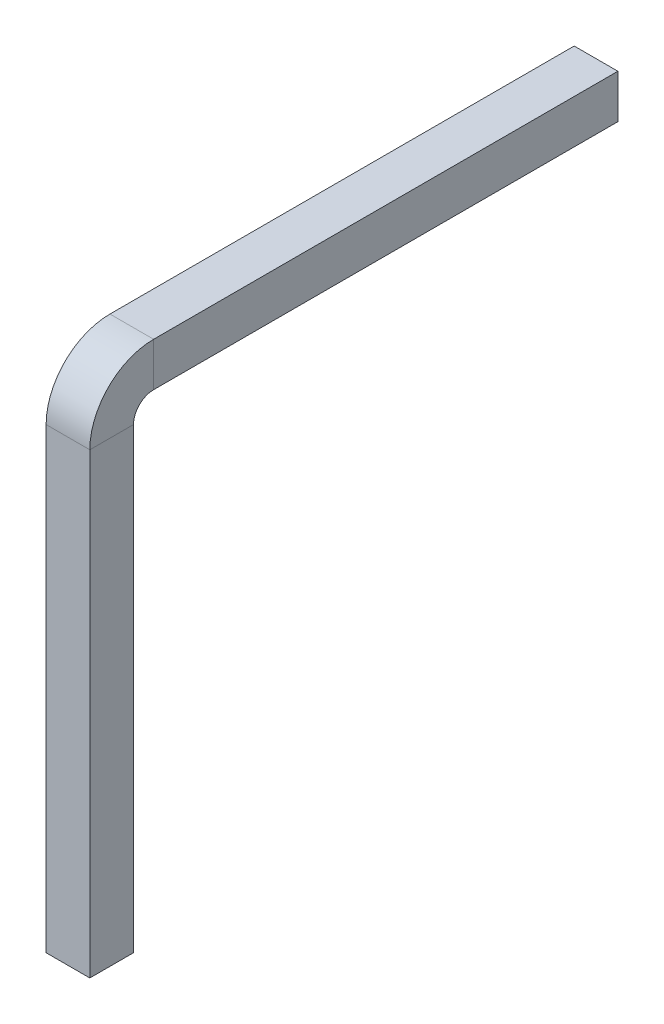
ISO-10303-21;
HEADER;
FILE_DESCRIPTION(('STEP AP214'),'2;1');
FILE_NAME('part.step','',(''),(''),'','','');
FILE_SCHEMA(('AUTOMOTIVE_DESIGN { 1 0 10303 214 1 1 1 1 }'));
ENDSEC;
DATA;
#1=APPLICATION_CONTEXT('core data for automotive mechanical design processes');
#2=APPLICATION_PROTOCOL_DEFINITION('international standard','automotive_design',2000,#1);
#3=PRODUCT_CONTEXT('',#1,'mechanical');
#4=PRODUCT('Part','Part','',(#3));
#5=PRODUCT_RELATED_PRODUCT_CATEGORY('part','',(#4));
#6=PRODUCT_DEFINITION_FORMATION('','',#4);
#7=PRODUCT_DEFINITION_CONTEXT('part definition',#1,'design');
#8=PRODUCT_DEFINITION('design','',#6,#7);
#9=PRODUCT_DEFINITION_SHAPE('','',#8);
#10=(LENGTH_UNIT() NAMED_UNIT(*) SI_UNIT(.MILLI.,.METRE.));
#11=(NAMED_UNIT(*) PLANE_ANGLE_UNIT() SI_UNIT($,.RADIAN.));
#12=(NAMED_UNIT(*) SI_UNIT($,.STERADIAN.) SOLID_ANGLE_UNIT());
#13=UNCERTAINTY_MEASURE_WITH_UNIT(LENGTH_MEASURE(1.E-05),#10,'distance_accuracy_value','');
#14=(GEOMETRIC_REPRESENTATION_CONTEXT(3) GLOBAL_UNCERTAINTY_ASSIGNED_CONTEXT((#13)) GLOBAL_UNIT_ASSIGNED_CONTEXT((#10,
#11,#12)) REPRESENTATION_CONTEXT('',''));
#15=CARTESIAN_POINT('',(0.,0.,0.));
#16=DIRECTION('',(0.,0.,1.));
#17=DIRECTION('',(1.,0.,0.));
#18=AXIS2_PLACEMENT_3D('',#15,#16,#17);
#19=CARTESIAN_POINT('',(0.,0.,0.));
#20=DIRECTION('',(0.,-1.,0.));
#21=DIRECTION('',(0.,0.,-1.));
#22=AXIS2_PLACEMENT_3D('',#19,#20,#21);
#23=PLANE('',#22);
#24=DIRECTION('',(0.,0.,1.));
#25=VECTOR('',#24,1.);
#26=CARTESIAN_POINT('',(0.120000000000001,0.,0.));
#27=LINE('',#26,#25);
#28=CARTESIAN_POINT('',(0.120000000000001,0.,-0.120000000000001));
#29=VERTEX_POINT('',#28);
#30=CARTESIAN_POINT('',(0.120000000000001,0.,0.120000000000002));
#31=VERTEX_POINT('',#30);
#32=EDGE_CURVE('E219',#29,#31,#27,.T.);
#33=ORIENTED_EDGE('',*,*,#32,.T.);
#34=DIRECTION('',(-1.,0.,0.));
#35=VECTOR('',#34,1.);
#36=CARTESIAN_POINT('',(0.,0.,0.120000000000002));
#37=LINE('',#36,#35);
#38=CARTESIAN_POINT('',(-0.120000000000001,0.,0.120000000000002));
#39=VERTEX_POINT('',#38);
#40=EDGE_CURVE('E221',#31,#39,#37,.T.);
#41=ORIENTED_EDGE('',*,*,#40,.T.);
#42=DIRECTION('',(0.,0.,-1.));
#43=VECTOR('',#42,1.);
#44=CARTESIAN_POINT('',(-0.120000000000001,0.,0.));
#45=LINE('',#44,#43);
#46=CARTESIAN_POINT('',(-0.120000000000001,0.,-0.120000000000001));
#47=VERTEX_POINT('',#46);
#48=EDGE_CURVE('E215',#39,#47,#45,.T.);
#49=ORIENTED_EDGE('',*,*,#48,.T.);
#50=DIRECTION('',(1.,0.,0.));
#51=VECTOR('',#50,1.);
#52=CARTESIAN_POINT('',(0.,0.,-0.120000000000001));
#53=LINE('',#52,#51);
#54=EDGE_CURVE('E217',#47,#29,#53,.T.);
#55=ORIENTED_EDGE('',*,*,#54,.T.);
#56=EDGE_LOOP('',(#33,#41,#49,#55));
#57=FACE_BOUND('',#56,.T.);
#58=ADVANCED_FACE('F33',(#57),#23,.T.);
#59=CARTESIAN_POINT('',(0.,7.51466781474061,-7.61466781474061));
#60=DIRECTION('',(0.,0.,1.));
#61=DIRECTION('',(0.,-1.,0.));
#62=AXIS2_PLACEMENT_3D('',#59,#60,#61);
#63=PLANE('',#62);
#64=DIRECTION('',(0.,-1.,0.));
#65=VECTOR('',#64,1.);
#66=CARTESIAN_POINT('',(0.12,7.19466781474061,-7.61466781474061));
#67=LINE('',#66,#65);
#68=CARTESIAN_POINT('',(0.12,7.63466781474061,-7.61466781474061));
#69=VERTEX_POINT('',#68);
#70=CARTESIAN_POINT('',(0.12,7.39466781474061,-7.61466781474061));
#71=VERTEX_POINT('',#70);
#72=EDGE_CURVE('E198',#69,#71,#67,.T.);
#73=ORIENTED_EDGE('',*,*,#72,.T.);
#74=DIRECTION('',(-1.,0.,0.));
#75=VECTOR('',#74,1.);
#76=CARTESIAN_POINT('',(-0.32,7.39466781474061,-7.61466781474061));
#77=LINE('',#76,#75);
#78=CARTESIAN_POINT('',(-0.119999999999999,7.39466781474061,-7.61466781474061));
#79=VERTEX_POINT('',#78);
#80=EDGE_CURVE('E200',#71,#79,#77,.T.);
#81=ORIENTED_EDGE('',*,*,#80,.T.);
#82=DIRECTION('',(0.,1.,0.));
#83=VECTOR('',#82,1.);
#84=CARTESIAN_POINT('',(-0.119999999999999,7.83466781474061,-7.61466781474061));
#85=LINE('',#84,#83);
#86=CARTESIAN_POINT('',(-0.119999999999999,7.63466781474061,-7.61466781474061));
#87=VERTEX_POINT('',#86);
#88=EDGE_CURVE('E191',#79,#87,#85,.T.);
#89=ORIENTED_EDGE('',*,*,#88,.T.);
#90=DIRECTION('',(1.,0.,0.));
#91=VECTOR('',#90,1.);
#92=CARTESIAN_POINT('',(0.32,7.63466781474061,-7.61466781474061));
#93=LINE('',#92,#91);
#94=EDGE_CURVE('E196',#87,#69,#93,.T.);
#95=ORIENTED_EDGE('',*,*,#94,.T.);
#96=EDGE_LOOP('',(#73,#81,#89,#95));
#97=FACE_BOUND('',#96,.T.);
#98=ADVANCED_FACE('F293',(#97),#63,.F.);
#99=CARTESIAN_POINT('',(-0.32,0.,-0.32));
#100=DIRECTION('',(-1.,0.,0.));
#101=DIRECTION('',(0.,0.,1.));
#102=AXIS2_PLACEMENT_3D('',#99,#100,#101);
#103=PLANE('',#102);
#104=DIRECTION('',(0.,1.,0.));
#105=VECTOR('',#104,1.);
#106=CARTESIAN_POINT('',(-0.32,0.,-0.32));
#107=LINE('',#106,#105);
#108=CARTESIAN_POINT('',(-0.32,0.199999999999999,-0.32));
#109=VERTEX_POINT('',#108);
#110=CARTESIAN_POINT('',(-0.32,6.9,-0.32));
#111=VERTEX_POINT('',#110);
#112=EDGE_CURVE('E121',#109,#111,#107,.T.);
#113=ORIENTED_EDGE('',*,*,#112,.F.);
#114=DIRECTION('',(0.,0.,1.));
#115=VECTOR('',#114,1.);
#116=CARTESIAN_POINT('',(-0.32,0.199999999999999,-0.32));
#117=LINE('',#116,#115);
#118=CARTESIAN_POINT('',(-0.32,0.199999999999999,0.32));
#119=VERTEX_POINT('',#118);
#120=EDGE_CURVE('E11',#109,#119,#117,.T.);
#121=ORIENTED_EDGE('',*,*,#120,.T.);
#122=DIRECTION('',(0.,1.,0.));
#123=VECTOR('',#122,1.);
#124=CARTESIAN_POINT('',(-0.32,0.,0.32));
#125=LINE('',#124,#123);
#126=CARTESIAN_POINT('',(-0.32,6.9,0.32));
#127=VERTEX_POINT('',#126);
#128=EDGE_CURVE('E153',#119,#127,#125,.T.);
#129=ORIENTED_EDGE('',*,*,#128,.T.);
#130=DIRECTION('',(0.,0.,1.));
#131=VECTOR('',#130,1.);
#132=CARTESIAN_POINT('',(-0.32,6.9,-0.32));
#133=LINE('',#132,#131);
#134=EDGE_CURVE('E130',#111,#127,#133,.T.);
#135=ORIENTED_EDGE('',*,*,#134,.F.);
#136=EDGE_LOOP('',(#113,#121,#129,#135));
#137=FACE_BOUND('',#136,.T.);
#138=ADVANCED_FACE('F151',(#137),#103,.T.);
#139=CARTESIAN_POINT('',(0.32,0.,0.320000000000001));
#140=DIRECTION('',(0.,0.,1.));
#141=DIRECTION('',(1.,0.,0.));
#142=AXIS2_PLACEMENT_3D('',#139,#140,#141);
#143=PLANE('',#142);
#144=ORIENTED_EDGE('',*,*,#128,.F.);
#145=DIRECTION('',(1.,0.,0.));
#146=VECTOR('',#145,1.);
#147=CARTESIAN_POINT('',(0.32,0.199999999999999,0.320000000000001));
#148=LINE('',#147,#146);
#149=CARTESIAN_POINT('',(0.32,0.199999999999999,0.320000000000001));
#150=VERTEX_POINT('',#149);
#151=EDGE_CURVE('E212',#119,#150,#148,.T.);
#152=ORIENTED_EDGE('',*,*,#151,.T.);
#153=DIRECTION('',(0.,1.,0.));
#154=VECTOR('',#153,1.);
#155=CARTESIAN_POINT('',(0.32,0.,0.320000000000001));
#156=LINE('',#155,#154);
#157=CARTESIAN_POINT('',(0.32,6.9,0.320000000000001));
#158=VERTEX_POINT('',#157);
#159=EDGE_CURVE('E173',#150,#158,#156,.T.);
#160=ORIENTED_EDGE('',*,*,#159,.T.);
#161=DIRECTION('',(1.,0.,0.));
#162=VECTOR('',#161,1.);
#163=CARTESIAN_POINT('',(0.32,6.9,0.320000000000001));
#164=LINE('',#163,#162);
#165=EDGE_CURVE('E156',#127,#158,#164,.T.);
#166=ORIENTED_EDGE('',*,*,#165,.F.);
#167=EDGE_LOOP('',(#144,#152,#160,#166));
#168=FACE_BOUND('',#167,.T.);
#169=ADVANCED_FACE('F259',(#168),#143,.T.);
#170=CARTESIAN_POINT('',(0.32,0.,-0.32));
#171=DIRECTION('',(1.,0.,0.));
#172=DIRECTION('',(0.,0.,-1.));
#173=AXIS2_PLACEMENT_3D('',#170,#171,#172);
#174=PLANE('',#173);
#175=ORIENTED_EDGE('',*,*,#159,.F.);
#176=DIRECTION('',(0.,0.,-1.));
#177=VECTOR('',#176,1.);
#178=CARTESIAN_POINT('',(0.32,0.199999999999999,-0.32));
#179=LINE('',#178,#177);
#180=CARTESIAN_POINT('',(0.32,0.199999999999999,-0.32));
#181=VERTEX_POINT('',#180);
#182=EDGE_CURVE('E57',#150,#181,#179,.T.);
#183=ORIENTED_EDGE('',*,*,#182,.T.);
#184=DIRECTION('',(0.,1.,0.));
#185=VECTOR('',#184,1.);
#186=CARTESIAN_POINT('',(0.32,0.,-0.32));
#187=LINE('',#186,#185);
#188=CARTESIAN_POINT('',(0.32,6.9,-0.32));
#189=VERTEX_POINT('',#188);
#190=EDGE_CURVE('E149',#181,#189,#187,.T.);
#191=ORIENTED_EDGE('',*,*,#190,.T.);
#192=DIRECTION('',(0.,0.,-1.));
#193=VECTOR('',#192,1.);
#194=CARTESIAN_POINT('',(0.32,6.9,-0.32));
#195=LINE('',#194,#193);
#196=EDGE_CURVE('E175',#158,#189,#195,.T.);
#197=ORIENTED_EDGE('',*,*,#196,.F.);
#198=EDGE_LOOP('',(#175,#183,#191,#197));
#199=FACE_BOUND('',#198,.T.);
#200=ADVANCED_FACE('F263',(#199),#174,.T.);
#201=CARTESIAN_POINT('',(0.32,0.,-0.32));
#202=DIRECTION('',(0.,0.,-1.));
#203=DIRECTION('',(-1.,0.,0.));
#204=AXIS2_PLACEMENT_3D('',#201,#202,#203);
#205=PLANE('',#204);
#206=ORIENTED_EDGE('',*,*,#190,.F.);
#207=DIRECTION('',(-1.,0.,0.));
#208=VECTOR('',#207,1.);
#209=CARTESIAN_POINT('',(0.32,0.199999999999999,-0.32));
#210=LINE('',#209,#208);
#211=EDGE_CURVE('E42',#181,#109,#210,.T.);
#212=ORIENTED_EDGE('',*,*,#211,.T.);
#213=ORIENTED_EDGE('',*,*,#112,.T.);
#214=DIRECTION('',(-1.,0.,0.));
#215=VECTOR('',#214,1.);
#216=CARTESIAN_POINT('',(0.32,6.9,-0.32));
#217=LINE('',#216,#215);
#218=EDGE_CURVE('E125',#189,#111,#217,.T.);
#219=ORIENTED_EDGE('',*,*,#218,.F.);
#220=EDGE_LOOP('',(#206,#212,#213,#219));
#221=FACE_BOUND('',#220,.T.);
#222=ADVANCED_FACE('F123',(#221),#205,.T.);
#223=CARTESIAN_POINT('',(-0.32,6.9,-0.32));
#224=DIRECTION('',(-1.,0.,0.));
#225=DIRECTION('',(0.,0.,1.));
#226=AXIS2_PLACEMENT_3D('',#223,#224,#225);
#227=PLANE('',#226);
#228=CARTESIAN_POINT('',(-0.32,6.9,-0.614667814740614));
#229=DIRECTION('',(-1.,0.,0.));
#230=DIRECTION('',(0.,0.,1.));
#231=AXIS2_PLACEMENT_3D('',#228,#229,#230);
#232=CIRCLE('',#231,0.934667814740614);
#233=CARTESIAN_POINT('',(-0.32,7.83466781474061,-0.614667814740621));
#234=VERTEX_POINT('',#233);
#235=EDGE_CURVE('E160',#127,#234,#232,.T.);
#236=ORIENTED_EDGE('',*,*,#235,.T.);
#237=DIRECTION('',(0.,1.,0.));
#238=VECTOR('',#237,1.);
#239=CARTESIAN_POINT('',(-0.32,7.19466781474061,-0.614667814740616));
#240=LINE('',#239,#238);
#241=CARTESIAN_POINT('',(-0.32,7.19466781474061,-0.614667814740616));
#242=VERTEX_POINT('',#241);
#243=EDGE_CURVE('E141',#242,#234,#240,.T.);
#244=ORIENTED_EDGE('',*,*,#243,.F.);
#245=CARTESIAN_POINT('',(-0.32,6.9,-0.614667814740614));
#246=DIRECTION('',(-1.,0.,0.));
#247=DIRECTION('',(0.,0.,1.));
#248=AXIS2_PLACEMENT_3D('',#245,#246,#247);
#249=CIRCLE('',#248,0.294667814740614);
#250=EDGE_CURVE('E137',#111,#242,#249,.T.);
#251=ORIENTED_EDGE('',*,*,#250,.F.);
#252=ORIENTED_EDGE('',*,*,#134,.T.);
#253=EDGE_LOOP('',(#236,#244,#251,#252));
#254=FACE_BOUND('',#253,.T.);
#255=ADVANCED_FACE('F139',(#254),#227,.T.);
#256=CARTESIAN_POINT('',(0.,6.9,-0.614667814740614));
#257=DIRECTION('',(-1.,0.,0.));
#258=DIRECTION('',(0.,0.,1.));
#259=AXIS2_PLACEMENT_3D('',#256,#257,#258);
#260=CYLINDRICAL_SURFACE('',#259,0.934667814740615);
#261=CARTESIAN_POINT('',(0.32,6.9,-0.614667814740614));
#262=DIRECTION('',(-1.,0.,0.));
#263=DIRECTION('',(0.,0.,1.));
#264=AXIS2_PLACEMENT_3D('',#261,#262,#263);
#265=CIRCLE('',#264,0.934667814740615);
#266=CARTESIAN_POINT('',(0.32,7.83466781474061,-0.614667814740621));
#267=VERTEX_POINT('',#266);
#268=EDGE_CURVE('E178',#158,#267,#265,.T.);
#269=ORIENTED_EDGE('',*,*,#268,.T.);
#270=DIRECTION('',(1.,0.,0.));
#271=VECTOR('',#270,1.);
#272=CARTESIAN_POINT('',(0.32,7.83466781474061,-0.614667814740621));
#273=LINE('',#272,#271);
#274=EDGE_CURVE('E161',#234,#267,#273,.T.);
#275=ORIENTED_EDGE('',*,*,#274,.F.);
#276=ORIENTED_EDGE('',*,*,#235,.F.);
#277=ORIENTED_EDGE('',*,*,#165,.T.);
#278=EDGE_LOOP('',(#269,#275,#276,#277));
#279=FACE_BOUND('',#278,.T.);
#280=ADVANCED_FACE('F266',(#279),#260,.T.);
#281=CARTESIAN_POINT('',(0.32,6.9,-0.32));
#282=DIRECTION('',(1.,0.,0.));
#283=DIRECTION('',(0.,0.,-1.));
#284=AXIS2_PLACEMENT_3D('',#281,#282,#283);
#285=PLANE('',#284);
#286=CARTESIAN_POINT('',(0.32,6.9,-0.614667814740614));
#287=DIRECTION('',(-1.,0.,0.));
#288=DIRECTION('',(0.,0.,1.));
#289=AXIS2_PLACEMENT_3D('',#286,#287,#288);
#290=CIRCLE('',#289,0.294667814740614);
#291=CARTESIAN_POINT('',(0.32,7.19466781474061,-0.614667814740616));
#292=VERTEX_POINT('',#291);
#293=EDGE_CURVE('E148',#189,#292,#290,.T.);
#294=ORIENTED_EDGE('',*,*,#293,.T.);
#295=DIRECTION('',(0.,-1.,0.));
#296=VECTOR('',#295,1.);
#297=CARTESIAN_POINT('',(0.32,7.19466781474061,-0.614667814740616));
#298=LINE('',#297,#296);
#299=EDGE_CURVE('E181',#267,#292,#298,.T.);
#300=ORIENTED_EDGE('',*,*,#299,.F.);
#301=ORIENTED_EDGE('',*,*,#268,.F.);
#302=ORIENTED_EDGE('',*,*,#196,.T.);
#303=EDGE_LOOP('',(#294,#300,#301,#302));
#304=FACE_BOUND('',#303,.T.);
#305=ADVANCED_FACE('F276',(#304),#285,.T.);
#306=CARTESIAN_POINT('',(0.,6.9,-0.614667814740614));
#307=DIRECTION('',(-1.,0.,0.));
#308=DIRECTION('',(0.,0.,1.));
#309=AXIS2_PLACEMENT_3D('',#306,#307,#308);
#310=CYLINDRICAL_SURFACE('',#309,0.294667814740614);
#311=DIRECTION('',(-1.,0.,0.));
#312=VECTOR('',#311,1.);
#313=CARTESIAN_POINT('',(0.32,7.19466781474061,-0.614667814740616));
#314=LINE('',#313,#312);
#315=EDGE_CURVE('E170',#292,#242,#314,.T.);
#316=ORIENTED_EDGE('',*,*,#315,.F.);
#317=ORIENTED_EDGE('',*,*,#293,.F.);
#318=ORIENTED_EDGE('',*,*,#218,.T.);
#319=ORIENTED_EDGE('',*,*,#250,.T.);
#320=EDGE_LOOP('',(#316,#317,#318,#319));
#321=FACE_BOUND('',#320,.T.);
#322=ADVANCED_FACE('F146',(#321),#310,.F.);
#323=CARTESIAN_POINT('',(-0.32,7.19466781474061,-0.614667814740619));
#324=DIRECTION('',(-1.,0.,0.));
#325=DIRECTION('',(0.,0.,1.));
#326=AXIS2_PLACEMENT_3D('',#323,#324,#325);
#327=PLANE('',#326);
#328=DIRECTION('',(0.,0.,-1.));
#329=VECTOR('',#328,1.);
#330=CARTESIAN_POINT('',(-0.32,7.83466781474061,-0.614667814740619));
#331=LINE('',#330,#329);
#332=CARTESIAN_POINT('',(-0.32,7.83466781474061,-7.41466781474061));
#333=VERTEX_POINT('',#332);
#334=EDGE_CURVE('E163',#234,#333,#331,.T.);
#335=ORIENTED_EDGE('',*,*,#334,.T.);
#336=DIRECTION('',(0.,-1.,0.));
#337=VECTOR('',#336,1.);
#338=CARTESIAN_POINT('',(-0.32,7.19466781474061,-7.41466781474061));
#339=LINE('',#338,#337);
#340=CARTESIAN_POINT('',(-0.32,7.19466781474061,-7.41466781474061));
#341=VERTEX_POINT('',#340);
#342=EDGE_CURVE('E210',#333,#341,#339,.T.);
#343=ORIENTED_EDGE('',*,*,#342,.T.);
#344=DIRECTION('',(0.,0.,-1.));
#345=VECTOR('',#344,1.);
#346=CARTESIAN_POINT('',(-0.32,7.19466781474061,-0.614667814740619));
#347=LINE('',#346,#345);
#348=EDGE_CURVE('E167',#242,#341,#347,.T.);
#349=ORIENTED_EDGE('',*,*,#348,.F.);
#350=ORIENTED_EDGE('',*,*,#243,.T.);
#351=EDGE_LOOP('',(#335,#343,#349,#350));
#352=FACE_BOUND('',#351,.T.);
#353=ADVANCED_FACE('F269',(#352),#327,.T.);
#354=CARTESIAN_POINT('',(0.32,7.83466781474061,-0.614667814740619));
#355=DIRECTION('',(0.,1.,0.));
#356=DIRECTION('',(-1.,0.,0.));
#357=AXIS2_PLACEMENT_3D('',#354,#355,#356);
#358=PLANE('',#357);
#359=DIRECTION('',(0.,0.,-1.));
#360=VECTOR('',#359,1.);
#361=CARTESIAN_POINT('',(0.32,7.83466781474061,-0.614667814740619));
#362=LINE('',#361,#360);
#363=CARTESIAN_POINT('',(0.32,7.83466781474061,-7.41466781474061));
#364=VERTEX_POINT('',#363);
#365=EDGE_CURVE('E166',#267,#364,#362,.T.);
#366=ORIENTED_EDGE('',*,*,#365,.T.);
#367=DIRECTION('',(-1.,0.,0.));
#368=VECTOR('',#367,1.);
#369=CARTESIAN_POINT('',(-0.32,7.83466781474061,-7.41466781474061));
#370=LINE('',#369,#368);
#371=EDGE_CURVE('E208',#364,#333,#370,.T.);
#372=ORIENTED_EDGE('',*,*,#371,.T.);
#373=ORIENTED_EDGE('',*,*,#334,.F.);
#374=ORIENTED_EDGE('',*,*,#274,.T.);
#375=EDGE_LOOP('',(#366,#372,#373,#374));
#376=FACE_BOUND('',#375,.T.);
#377=ADVANCED_FACE('F282',(#376),#358,.T.);
#378=CARTESIAN_POINT('',(0.32,7.19466781474061,-0.614667814740619));
#379=DIRECTION('',(1.,0.,0.));
#380=DIRECTION('',(0.,0.,-1.));
#381=AXIS2_PLACEMENT_3D('',#378,#379,#380);
#382=PLANE('',#381);
#383=DIRECTION('',(0.,0.,-1.));
#384=VECTOR('',#383,1.);
#385=CARTESIAN_POINT('',(0.32,7.19466781474061,-0.614667814740619));
#386=LINE('',#385,#384);
#387=CARTESIAN_POINT('',(0.32,7.19466781474061,-7.41466781474061));
#388=VERTEX_POINT('',#387);
#389=EDGE_CURVE('E184',#292,#388,#386,.T.);
#390=ORIENTED_EDGE('',*,*,#389,.T.);
#391=DIRECTION('',(0.,1.,0.));
#392=VECTOR('',#391,1.);
#393=CARTESIAN_POINT('',(0.32,7.83466781474061,-7.41466781474061));
#394=LINE('',#393,#392);
#395=EDGE_CURVE('E206',#388,#364,#394,.T.);
#396=ORIENTED_EDGE('',*,*,#395,.T.);
#397=ORIENTED_EDGE('',*,*,#365,.F.);
#398=ORIENTED_EDGE('',*,*,#299,.T.);
#399=EDGE_LOOP('',(#390,#396,#397,#398));
#400=FACE_BOUND('',#399,.T.);
#401=ADVANCED_FACE('F278',(#400),#382,.T.);
#402=CARTESIAN_POINT('',(0.32,7.19466781474061,-0.614667814740619));
#403=DIRECTION('',(0.,-1.,0.));
#404=DIRECTION('',(1.,0.,0.));
#405=AXIS2_PLACEMENT_3D('',#402,#403,#404);
#406=PLANE('',#405);
#407=ORIENTED_EDGE('',*,*,#348,.T.);
#408=DIRECTION('',(1.,0.,0.));
#409=VECTOR('',#408,1.);
#410=CARTESIAN_POINT('',(0.32,7.19466781474061,-7.41466781474061));
#411=LINE('',#410,#409);
#412=EDGE_CURVE('E203',#341,#388,#411,.T.);
#413=ORIENTED_EDGE('',*,*,#412,.T.);
#414=ORIENTED_EDGE('',*,*,#389,.F.);
#415=ORIENTED_EDGE('',*,*,#315,.T.);
#416=EDGE_LOOP('',(#407,#413,#414,#415));
#417=FACE_BOUND('',#416,.T.);
#418=ADVANCED_FACE('F274',(#417),#406,.T.);
#419=CARTESIAN_POINT('',(0.,7.63466781474061,-7.61466781474061));
#420=DIRECTION('',(0.,0.707106781186548,-0.707106781186547));
#421=DIRECTION('',(-1.,0.,0.));
#422=AXIS2_PLACEMENT_3D('',#419,#420,#421);
#423=PLANE('',#422);
#424=DIRECTION('',(0.577350269189626,-0.577350269189625,-0.577350269189626));
#425=VECTOR('',#424,1.);
#426=CARTESIAN_POINT('',(-0.0799999999999995,7.59466781474061,-7.65466781474061));
#427=LINE('',#426,#425);
#428=EDGE_CURVE('E230',#333,#87,#427,.T.);
#429=ORIENTED_EDGE('',*,*,#428,.F.);
#430=ORIENTED_EDGE('',*,*,#371,.F.);
#431=DIRECTION('',(-0.577350269189626,-0.577350269189626,-0.577350269189626));
#432=VECTOR('',#431,1.);
#433=CARTESIAN_POINT('',(0.0799999999999996,7.59466781474061,-7.65466781474061));
#434=LINE('',#433,#432);
#435=EDGE_CURVE('E131',#69,#364,#434,.F.);
#436=ORIENTED_EDGE('',*,*,#435,.F.);
#437=ORIENTED_EDGE('',*,*,#94,.F.);
#438=EDGE_LOOP('',(#429,#430,#436,#437));
#439=FACE_BOUND('',#438,.T.);
#440=ADVANCED_FACE('F285',(#439),#423,.T.);
#441=CARTESIAN_POINT('',(0.12,7.51466781474061,-7.61466781474061));
#442=DIRECTION('',(0.707106781186548,0.,-0.707106781186547));
#443=DIRECTION('',(0.,1.,0.));
#444=AXIS2_PLACEMENT_3D('',#441,#442,#443);
#445=PLANE('',#444);
#446=ORIENTED_EDGE('',*,*,#435,.T.);
#447=ORIENTED_EDGE('',*,*,#395,.F.);
#448=DIRECTION('',(-0.577350269189626,0.577350269189626,-0.577350269189626));
#449=VECTOR('',#448,1.);
#450=CARTESIAN_POINT('',(0.0799999999999998,7.43466781474061,-7.65466781474061));
#451=LINE('',#450,#449);
#452=EDGE_CURVE('E228',#71,#388,#451,.F.);
#453=ORIENTED_EDGE('',*,*,#452,.F.);
#454=ORIENTED_EDGE('',*,*,#72,.F.);
#455=EDGE_LOOP('',(#446,#447,#453,#454));
#456=FACE_BOUND('',#455,.T.);
#457=ADVANCED_FACE('F289',(#456),#445,.T.);
#458=CARTESIAN_POINT('',(-0.119999999999999,7.51466781474061,-7.61466781474061));
#459=DIRECTION('',(-0.707106781186547,0.,-0.707106781186547));
#460=DIRECTION('',(0.,-1.,0.));
#461=AXIS2_PLACEMENT_3D('',#458,#459,#460);
#462=PLANE('',#461);
#463=ORIENTED_EDGE('',*,*,#428,.T.);
#464=ORIENTED_EDGE('',*,*,#88,.F.);
#465=DIRECTION('',(-0.577350269189626,-0.577350269189626,0.577350269189626));
#466=VECTOR('',#465,1.);
#467=CARTESIAN_POINT('',(-0.0799999999999997,7.43466781474061,-7.65466781474061));
#468=LINE('',#467,#466);
#469=EDGE_CURVE('E226',#341,#79,#468,.F.);
#470=ORIENTED_EDGE('',*,*,#469,.F.);
#471=ORIENTED_EDGE('',*,*,#342,.F.);
#472=EDGE_LOOP('',(#463,#464,#470,#471));
#473=FACE_BOUND('',#472,.T.);
#474=ADVANCED_FACE('F296',(#473),#462,.T.);
#475=CARTESIAN_POINT('',(0.,7.39466781474061,-7.61466781474061));
#476=DIRECTION('',(0.,-0.707106781186547,-0.707106781186548));
#477=DIRECTION('',(1.,0.,0.));
#478=AXIS2_PLACEMENT_3D('',#475,#476,#477);
#479=PLANE('',#478);
#480=ORIENTED_EDGE('',*,*,#452,.T.);
#481=ORIENTED_EDGE('',*,*,#412,.F.);
#482=ORIENTED_EDGE('',*,*,#469,.T.);
#483=ORIENTED_EDGE('',*,*,#80,.F.);
#484=EDGE_LOOP('',(#480,#481,#482,#483));
#485=FACE_BOUND('',#484,.T.);
#486=ADVANCED_FACE('F299',(#485),#479,.T.);
#487=CARTESIAN_POINT('',(0.32,0.199999999999999,-0.32));
#488=DIRECTION('',(0.,0.707106781186547,0.707106781186548));
#489=DIRECTION('',(-1.,0.,0.));
#490=AXIS2_PLACEMENT_3D('',#487,#488,#489);
#491=PLANE('',#490);
#492=DIRECTION('',(-0.577350269189626,-0.577350269189626,0.577350269189626));
#493=VECTOR('',#492,1.);
#494=CARTESIAN_POINT('',(0.32,0.199999999999999,-0.32));
#495=LINE('',#494,#493);
#496=EDGE_CURVE('E238',#29,#181,#495,.F.);
#497=ORIENTED_EDGE('',*,*,#496,.F.);
#498=ORIENTED_EDGE('',*,*,#54,.F.);
#499=DIRECTION('',(0.577350269189626,-0.577350269189626,0.577350269189626));
#500=VECTOR('',#499,1.);
#501=CARTESIAN_POINT('',(-0.32,0.199999999999999,-0.32));
#502=LINE('',#501,#500);
#503=EDGE_CURVE('E37',#109,#47,#502,.T.);
#504=ORIENTED_EDGE('',*,*,#503,.F.);
#505=ORIENTED_EDGE('',*,*,#211,.F.);
#506=EDGE_LOOP('',(#497,#498,#504,#505));
#507=FACE_BOUND('',#506,.T.);
#508=ADVANCED_FACE('F35',(#507),#491,.F.);
#509=CARTESIAN_POINT('',(-0.32,0.199999999999999,-0.32));
#510=DIRECTION('',(0.707106781186548,0.707106781186547,0.));
#511=DIRECTION('',(0.,0.,1.));
#512=AXIS2_PLACEMENT_3D('',#509,#510,#511);
#513=PLANE('',#512);
#514=ORIENTED_EDGE('',*,*,#503,.T.);
#515=ORIENTED_EDGE('',*,*,#48,.F.);
#516=DIRECTION('',(-0.577350269189626,0.577350269189626,0.577350269189625));
#517=VECTOR('',#516,1.);
#518=CARTESIAN_POINT('',(-0.106666666666667,-0.0133333333333345,0.106666666666667));
#519=LINE('',#518,#517);
#520=EDGE_CURVE('E237',#119,#39,#519,.F.);
#521=ORIENTED_EDGE('',*,*,#520,.F.);
#522=ORIENTED_EDGE('',*,*,#120,.F.);
#523=EDGE_LOOP('',(#514,#515,#521,#522));
#524=FACE_BOUND('',#523,.T.);
#525=ADVANCED_FACE('F247',(#524),#513,.F.);
#526=CARTESIAN_POINT('',(0.32,0.199999999999999,-0.32));
#527=DIRECTION('',(-0.707106781186548,0.707106781186548,0.));
#528=DIRECTION('',(0.,0.,-1.));
#529=AXIS2_PLACEMENT_3D('',#526,#527,#528);
#530=PLANE('',#529);
#531=ORIENTED_EDGE('',*,*,#496,.T.);
#532=ORIENTED_EDGE('',*,*,#182,.F.);
#533=DIRECTION('',(-0.577350269189626,-0.577350269189626,-0.577350269189626));
#534=VECTOR('',#533,1.);
#535=CARTESIAN_POINT('',(0.106666666666666,-0.0133333333333349,0.106666666666667));
#536=LINE('',#535,#534);
#537=EDGE_CURVE('E235',#31,#150,#536,.F.);
#538=ORIENTED_EDGE('',*,*,#537,.F.);
#539=ORIENTED_EDGE('',*,*,#32,.F.);
#540=EDGE_LOOP('',(#531,#532,#538,#539));
#541=FACE_BOUND('',#540,.T.);
#542=ADVANCED_FACE('F257',(#541),#530,.F.);
#543=CARTESIAN_POINT('',(0.32,0.199999999999999,0.320000000000001));
#544=DIRECTION('',(0.,0.707106781186547,-0.707106781186548));
#545=DIRECTION('',(1.,0.,0.));
#546=AXIS2_PLACEMENT_3D('',#543,#544,#545);
#547=PLANE('',#546);
#548=ORIENTED_EDGE('',*,*,#520,.T.);
#549=ORIENTED_EDGE('',*,*,#40,.F.);
#550=ORIENTED_EDGE('',*,*,#537,.T.);
#551=ORIENTED_EDGE('',*,*,#151,.F.);
#552=EDGE_LOOP('',(#548,#549,#550,#551));
#553=FACE_BOUND('',#552,.T.);
#554=ADVANCED_FACE('F255',(#553),#547,.F.);
#555=CLOSED_SHELL('',(#58,#98,#138,#169,#200,#222,#255,#280,#305,#322,#353,#377,#401,#418,#440,
#457,#474,#486,#508,#525,#542,#554));
#556=MANIFOLD_SOLID_BREP('B2',#555);
#557=ADVANCED_BREP_SHAPE_REPRESENTATION('',(#18,#556),#14);
#558=SHAPE_DEFINITION_REPRESENTATION(#9,#557);
ENDSEC;
END-ISO-10303-21;
